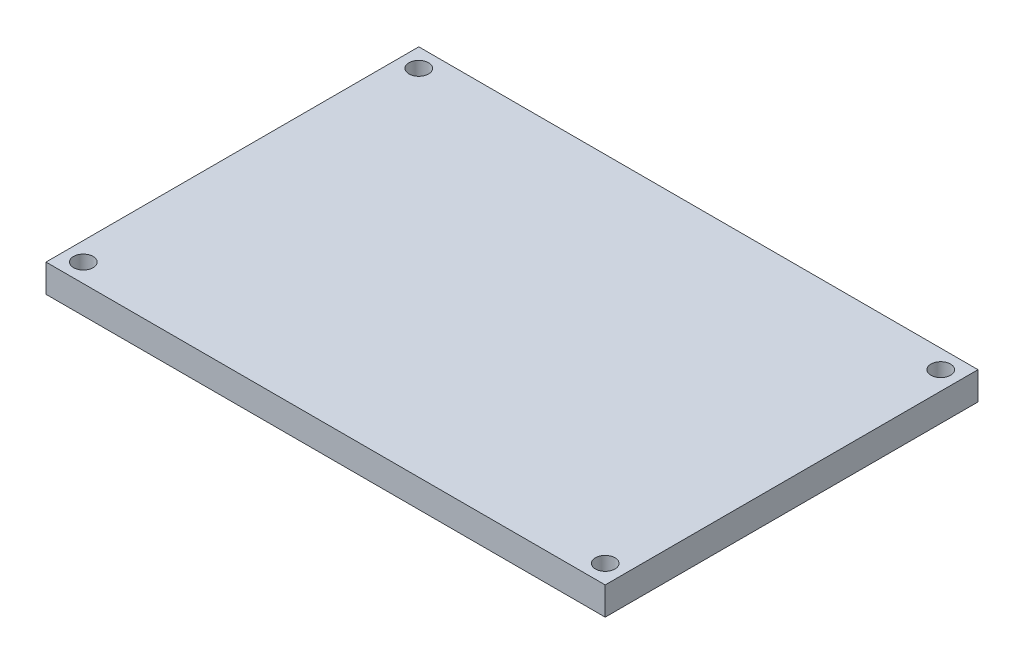
ISO-10303-21;
HEADER;
FILE_DESCRIPTION(('STEP AP214'),'2;1');
FILE_NAME('part.step','',(''),(''),'','','');
FILE_SCHEMA(('AUTOMOTIVE_DESIGN { 1 0 10303 214 1 1 1 1 }'));
ENDSEC;
DATA;
#1=APPLICATION_CONTEXT('core data for automotive mechanical design processes');
#2=APPLICATION_PROTOCOL_DEFINITION('international standard','automotive_design',2000,#1);
#3=PRODUCT_CONTEXT('',#1,'mechanical');
#4=PRODUCT('Part','Part','',(#3));
#5=PRODUCT_RELATED_PRODUCT_CATEGORY('part','',(#4));
#6=PRODUCT_DEFINITION_FORMATION('','',#4);
#7=PRODUCT_DEFINITION_CONTEXT('part definition',#1,'design');
#8=PRODUCT_DEFINITION('design','',#6,#7);
#9=PRODUCT_DEFINITION_SHAPE('','',#8);
#10=(LENGTH_UNIT() NAMED_UNIT(*) SI_UNIT(.MILLI.,.METRE.));
#11=(NAMED_UNIT(*) PLANE_ANGLE_UNIT() SI_UNIT($,.RADIAN.));
#12=(NAMED_UNIT(*) SI_UNIT($,.STERADIAN.) SOLID_ANGLE_UNIT());
#13=UNCERTAINTY_MEASURE_WITH_UNIT(LENGTH_MEASURE(1.E-05),#10,'distance_accuracy_value','');
#14=(GEOMETRIC_REPRESENTATION_CONTEXT(3) GLOBAL_UNCERTAINTY_ASSIGNED_CONTEXT((#13)) GLOBAL_UNIT_ASSIGNED_CONTEXT((#10,
#11,#12)) REPRESENTATION_CONTEXT('',''));
#15=CARTESIAN_POINT('',(0.,0.,0.));
#16=DIRECTION('',(0.,0.,1.));
#17=DIRECTION('',(1.,0.,0.));
#18=AXIS2_PLACEMENT_3D('',#15,#16,#17);
#19=CARTESIAN_POINT('',(0.,3.,-20.));
#20=DIRECTION('',(0.,0.,-1.));
#21=DIRECTION('',(-1.,0.,0.));
#22=AXIS2_PLACEMENT_3D('',#19,#20,#21);
#23=PLANE('',#22);
#24=DIRECTION('',(1.,0.,0.));
#25=VECTOR('',#24,1.);
#26=CARTESIAN_POINT('',(0.,0.,-20.));
#27=LINE('',#26,#25);
#28=CARTESIAN_POINT('',(-30.,0.,-20.));
#29=VERTEX_POINT('',#28);
#30=CARTESIAN_POINT('',(30.,0.,-20.));
#31=VERTEX_POINT('',#30);
#32=EDGE_CURVE('E117',#29,#31,#27,.T.);
#33=ORIENTED_EDGE('',*,*,#32,.F.);
#34=DIRECTION('',(0.,-1.,0.));
#35=VECTOR('',#34,1.);
#36=CARTESIAN_POINT('',(-30.,3.,-20.));
#37=LINE('',#36,#35);
#38=CARTESIAN_POINT('',(-30.,3.,-20.));
#39=VERTEX_POINT('',#38);
#40=EDGE_CURVE('E11',#39,#29,#37,.T.);
#41=ORIENTED_EDGE('',*,*,#40,.F.);
#42=DIRECTION('',(1.,0.,0.));
#43=VECTOR('',#42,1.);
#44=CARTESIAN_POINT('',(0.,3.,-20.));
#45=LINE('',#44,#43);
#46=CARTESIAN_POINT('',(30.,3.,-20.));
#47=VERTEX_POINT('',#46);
#48=EDGE_CURVE('E90',#39,#47,#45,.T.);
#49=ORIENTED_EDGE('',*,*,#48,.T.);
#50=DIRECTION('',(0.,-1.,0.));
#51=VECTOR('',#50,1.);
#52=CARTESIAN_POINT('',(30.,3.,-20.));
#53=LINE('',#52,#51);
#54=EDGE_CURVE('E57',#47,#31,#53,.T.);
#55=ORIENTED_EDGE('',*,*,#54,.T.);
#56=EDGE_LOOP('',(#33,#41,#49,#55));
#57=FACE_BOUND('',#56,.T.);
#58=ADVANCED_FACE('F41',(#57),#23,.T.);
#59=CARTESIAN_POINT('',(-30.,3.,0.));
#60=DIRECTION('',(1.,0.,0.));
#61=DIRECTION('',(0.,0.,-1.));
#62=AXIS2_PLACEMENT_3D('',#59,#60,#61);
#63=PLANE('',#62);
#64=DIRECTION('',(0.,0.,1.));
#65=VECTOR('',#64,1.);
#66=CARTESIAN_POINT('',(-30.,0.,0.));
#67=LINE('',#66,#65);
#68=CARTESIAN_POINT('',(-30.,0.,20.));
#69=VERTEX_POINT('',#68);
#70=EDGE_CURVE('E96',#29,#69,#67,.T.);
#71=ORIENTED_EDGE('',*,*,#70,.T.);
#72=DIRECTION('',(0.,-1.,0.));
#73=VECTOR('',#72,1.);
#74=CARTESIAN_POINT('',(-30.,3.,20.));
#75=LINE('',#74,#73);
#76=CARTESIAN_POINT('',(-30.,3.,20.));
#77=VERTEX_POINT('',#76);
#78=EDGE_CURVE('E49',#77,#69,#75,.T.);
#79=ORIENTED_EDGE('',*,*,#78,.F.);
#80=DIRECTION('',(0.,0.,1.));
#81=VECTOR('',#80,1.);
#82=CARTESIAN_POINT('',(-30.,3.,0.));
#83=LINE('',#82,#81);
#84=EDGE_CURVE('E83',#39,#77,#83,.T.);
#85=ORIENTED_EDGE('',*,*,#84,.F.);
#86=ORIENTED_EDGE('',*,*,#40,.T.);
#87=EDGE_LOOP('',(#71,#79,#85,#86));
#88=FACE_BOUND('',#87,.T.);
#89=ADVANCED_FACE('F94',(#88),#63,.F.);
#90=CARTESIAN_POINT('',(0.,3.,20.));
#91=DIRECTION('',(0.,0.,-1.));
#92=DIRECTION('',(-1.,0.,0.));
#93=AXIS2_PLACEMENT_3D('',#90,#91,#92);
#94=PLANE('',#93);
#95=DIRECTION('',(1.,0.,0.));
#96=VECTOR('',#95,1.);
#97=CARTESIAN_POINT('',(0.,0.,20.));
#98=LINE('',#97,#96);
#99=CARTESIAN_POINT('',(30.,0.,20.));
#100=VERTEX_POINT('',#99);
#101=EDGE_CURVE('E120',#69,#100,#98,.T.);
#102=ORIENTED_EDGE('',*,*,#101,.T.);
#103=DIRECTION('',(0.,-1.,0.));
#104=VECTOR('',#103,1.);
#105=CARTESIAN_POINT('',(30.,3.,20.));
#106=LINE('',#105,#104);
#107=CARTESIAN_POINT('',(30.,3.,20.));
#108=VERTEX_POINT('',#107);
#109=EDGE_CURVE('E71',#108,#100,#106,.T.);
#110=ORIENTED_EDGE('',*,*,#109,.F.);
#111=DIRECTION('',(1.,0.,0.));
#112=VECTOR('',#111,1.);
#113=CARTESIAN_POINT('',(0.,3.,20.));
#114=LINE('',#113,#112);
#115=EDGE_CURVE('E89',#77,#108,#114,.T.);
#116=ORIENTED_EDGE('',*,*,#115,.F.);
#117=ORIENTED_EDGE('',*,*,#78,.T.);
#118=EDGE_LOOP('',(#102,#110,#116,#117));
#119=FACE_BOUND('',#118,.T.);
#120=ADVANCED_FACE('F99',(#119),#94,.F.);
#121=CARTESIAN_POINT('',(-28.,3.,-18.));
#122=DIRECTION('',(0.,-1.,0.));
#123=DIRECTION('',(0.,0.,-1.));
#124=AXIS2_PLACEMENT_3D('',#121,#122,#123);
#125=CYLINDRICAL_SURFACE('',#124,1.05);
#126=CARTESIAN_POINT('',(-28.,3.,-18.));
#127=DIRECTION('',(0.,1.,0.));
#128=DIRECTION('',(0.,0.,1.));
#129=AXIS2_PLACEMENT_3D('',#126,#127,#128);
#130=CIRCLE('',#129,1.05);
#131=CARTESIAN_POINT('',(-28.,3.,-16.95));
#132=VERTEX_POINT('',#131);
#133=EDGE_CURVE('E111',#132,#132,#130,.T.);
#134=ORIENTED_EDGE('',*,*,#133,.T.);
#135=EDGE_LOOP('',(#134));
#136=FACE_BOUND('',#135,.T.);
#137=CARTESIAN_POINT('',(-28.,0.,-18.));
#138=DIRECTION('',(0.,1.,0.));
#139=DIRECTION('',(0.,0.,1.));
#140=AXIS2_PLACEMENT_3D('',#137,#138,#139);
#141=CIRCLE('',#140,1.05);
#142=CARTESIAN_POINT('',(-28.,0.,-16.95));
#143=VERTEX_POINT('',#142);
#144=EDGE_CURVE('E131',#143,#143,#141,.T.);
#145=ORIENTED_EDGE('',*,*,#144,.F.);
#146=EDGE_LOOP('',(#145));
#147=FACE_BOUND('',#146,.T.);
#148=ADVANCED_FACE('F162',(#136,#147),#125,.F.);
#149=CARTESIAN_POINT('',(-28.,3.,18.));
#150=DIRECTION('',(0.,-1.,0.));
#151=DIRECTION('',(0.,0.,-1.));
#152=AXIS2_PLACEMENT_3D('',#149,#150,#151);
#153=CYLINDRICAL_SURFACE('',#152,1.05);
#154=CARTESIAN_POINT('',(-28.,3.,18.));
#155=DIRECTION('',(0.,1.,0.));
#156=DIRECTION('',(0.,0.,1.));
#157=AXIS2_PLACEMENT_3D('',#154,#155,#156);
#158=CIRCLE('',#157,1.05);
#159=CARTESIAN_POINT('',(-28.,3.,19.05));
#160=VERTEX_POINT('',#159);
#161=EDGE_CURVE('E108',#160,#160,#158,.T.);
#162=ORIENTED_EDGE('',*,*,#161,.T.);
#163=EDGE_LOOP('',(#162));
#164=FACE_BOUND('',#163,.T.);
#165=CARTESIAN_POINT('',(-28.,0.,18.));
#166=DIRECTION('',(0.,1.,0.));
#167=DIRECTION('',(0.,0.,1.));
#168=AXIS2_PLACEMENT_3D('',#165,#166,#167);
#169=CIRCLE('',#168,1.05);
#170=CARTESIAN_POINT('',(-28.,0.,19.05));
#171=VERTEX_POINT('',#170);
#172=EDGE_CURVE('E128',#171,#171,#169,.T.);
#173=ORIENTED_EDGE('',*,*,#172,.F.);
#174=EDGE_LOOP('',(#173));
#175=FACE_BOUND('',#174,.T.);
#176=ADVANCED_FACE('F151',(#164,#175),#153,.F.);
#177=CARTESIAN_POINT('',(28.,3.,18.));
#178=DIRECTION('',(0.,-1.,0.));
#179=DIRECTION('',(0.,0.,-1.));
#180=AXIS2_PLACEMENT_3D('',#177,#178,#179);
#181=CYLINDRICAL_SURFACE('',#180,1.05);
#182=CARTESIAN_POINT('',(28.,3.,18.));
#183=DIRECTION('',(0.,1.,0.));
#184=DIRECTION('',(0.,0.,1.));
#185=AXIS2_PLACEMENT_3D('',#182,#183,#184);
#186=CIRCLE('',#185,1.05);
#187=CARTESIAN_POINT('',(28.,3.,19.05));
#188=VERTEX_POINT('',#187);
#189=EDGE_CURVE('E102',#188,#188,#186,.F.);
#190=ORIENTED_EDGE('',*,*,#189,.F.);
#191=EDGE_LOOP('',(#190));
#192=FACE_BOUND('',#191,.T.);
#193=CARTESIAN_POINT('',(28.,0.,18.));
#194=DIRECTION('',(0.,1.,0.));
#195=DIRECTION('',(0.,0.,1.));
#196=AXIS2_PLACEMENT_3D('',#193,#194,#195);
#197=CIRCLE('',#196,1.05);
#198=CARTESIAN_POINT('',(28.,0.,19.05));
#199=VERTEX_POINT('',#198);
#200=EDGE_CURVE('E125',#199,#199,#197,.F.);
#201=ORIENTED_EDGE('',*,*,#200,.T.);
#202=EDGE_LOOP('',(#201));
#203=FACE_BOUND('',#202,.T.);
#204=ADVANCED_FACE('F143',(#192,#203),#181,.F.);
#205=CARTESIAN_POINT('',(30.,3.,0.));
#206=DIRECTION('',(1.,0.,0.));
#207=DIRECTION('',(0.,0.,-1.));
#208=AXIS2_PLACEMENT_3D('',#205,#206,#207);
#209=PLANE('',#208);
#210=DIRECTION('',(0.,0.,1.));
#211=VECTOR('',#210,1.);
#212=CARTESIAN_POINT('',(30.,0.,0.));
#213=LINE('',#212,#211);
#214=EDGE_CURVE('E122',#31,#100,#213,.T.);
#215=ORIENTED_EDGE('',*,*,#214,.F.);
#216=ORIENTED_EDGE('',*,*,#54,.F.);
#217=DIRECTION('',(0.,0.,1.));
#218=VECTOR('',#217,1.);
#219=CARTESIAN_POINT('',(30.,3.,0.));
#220=LINE('',#219,#218);
#221=EDGE_CURVE('E100',#47,#108,#220,.T.);
#222=ORIENTED_EDGE('',*,*,#221,.T.);
#223=ORIENTED_EDGE('',*,*,#109,.T.);
#224=EDGE_LOOP('',(#215,#216,#222,#223));
#225=FACE_BOUND('',#224,.T.);
#226=ADVANCED_FACE('F140',(#225),#209,.T.);
#227=CARTESIAN_POINT('',(28.,3.,-18.));
#228=DIRECTION('',(0.,-1.,0.));
#229=DIRECTION('',(0.,0.,-1.));
#230=AXIS2_PLACEMENT_3D('',#227,#228,#229);
#231=CYLINDRICAL_SURFACE('',#230,1.05);
#232=CARTESIAN_POINT('',(28.,3.,-18.));
#233=DIRECTION('',(0.,1.,0.));
#234=DIRECTION('',(0.,0.,1.));
#235=AXIS2_PLACEMENT_3D('',#232,#233,#234);
#236=CIRCLE('',#235,1.05);
#237=CARTESIAN_POINT('',(28.,3.,-16.95));
#238=VERTEX_POINT('',#237);
#239=EDGE_CURVE('E114',#238,#238,#236,.F.);
#240=ORIENTED_EDGE('',*,*,#239,.F.);
#241=EDGE_LOOP('',(#240));
#242=FACE_BOUND('',#241,.T.);
#243=CARTESIAN_POINT('',(28.,0.,-18.));
#244=DIRECTION('',(0.,1.,0.));
#245=DIRECTION('',(0.,0.,1.));
#246=AXIS2_PLACEMENT_3D('',#243,#244,#245);
#247=CIRCLE('',#246,1.05);
#248=CARTESIAN_POINT('',(28.,0.,-16.95));
#249=VERTEX_POINT('',#248);
#250=EDGE_CURVE('E134',#249,#249,#247,.F.);
#251=ORIENTED_EDGE('',*,*,#250,.T.);
#252=EDGE_LOOP('',(#251));
#253=FACE_BOUND('',#252,.T.);
#254=ADVANCED_FACE('F142',(#242,#253),#231,.F.);
#255=CARTESIAN_POINT('',(0.,3.,0.));
#256=DIRECTION('',(0.,1.,0.));
#257=DIRECTION('',(0.,0.,1.));
#258=AXIS2_PLACEMENT_3D('',#255,#256,#257);
#259=PLANE('',#258);
#260=ORIENTED_EDGE('',*,*,#48,.F.);
#261=ORIENTED_EDGE('',*,*,#84,.T.);
#262=ORIENTED_EDGE('',*,*,#115,.T.);
#263=ORIENTED_EDGE('',*,*,#221,.F.);
#264=EDGE_LOOP('',(#260,#261,#262,#263));
#265=FACE_BOUND('',#264,.T.);
#266=ORIENTED_EDGE('',*,*,#189,.T.);
#267=EDGE_LOOP('',(#266));
#268=FACE_BOUND('',#267,.T.);
#269=ORIENTED_EDGE('',*,*,#161,.F.);
#270=EDGE_LOOP('',(#269));
#271=FACE_BOUND('',#270,.T.);
#272=ORIENTED_EDGE('',*,*,#133,.F.);
#273=EDGE_LOOP('',(#272));
#274=FACE_BOUND('',#273,.T.);
#275=ORIENTED_EDGE('',*,*,#239,.T.);
#276=EDGE_LOOP('',(#275));
#277=FACE_BOUND('',#276,.T.);
#278=ADVANCED_FACE('F85',(#265,#268,#271,#274,#277),#259,.T.);
#279=CARTESIAN_POINT('',(0.,0.,0.));
#280=DIRECTION('',(0.,1.,0.));
#281=DIRECTION('',(0.,0.,1.));
#282=AXIS2_PLACEMENT_3D('',#279,#280,#281);
#283=PLANE('',#282);
#284=ORIENTED_EDGE('',*,*,#32,.T.);
#285=ORIENTED_EDGE('',*,*,#214,.T.);
#286=ORIENTED_EDGE('',*,*,#101,.F.);
#287=ORIENTED_EDGE('',*,*,#70,.F.);
#288=EDGE_LOOP('',(#284,#285,#286,#287));
#289=FACE_BOUND('',#288,.T.);
#290=ORIENTED_EDGE('',*,*,#200,.F.);
#291=EDGE_LOOP('',(#290));
#292=FACE_BOUND('',#291,.T.);
#293=ORIENTED_EDGE('',*,*,#172,.T.);
#294=EDGE_LOOP('',(#293));
#295=FACE_BOUND('',#294,.T.);
#296=ORIENTED_EDGE('',*,*,#144,.T.);
#297=EDGE_LOOP('',(#296));
#298=FACE_BOUND('',#297,.T.);
#299=ORIENTED_EDGE('',*,*,#250,.F.);
#300=EDGE_LOOP('',(#299));
#301=FACE_BOUND('',#300,.T.);
#302=ADVANCED_FACE('F175',(#289,#292,#295,#298,#301),#283,.F.);
#303=CLOSED_SHELL('',(#58,#89,#120,#148,#176,#204,#226,#254,#278,#302));
#304=MANIFOLD_SOLID_BREP('B2',#303);
#305=ADVANCED_BREP_SHAPE_REPRESENTATION('',(#18,#304),#14);
#306=SHAPE_DEFINITION_REPRESENTATION(#9,#305);
ENDSEC;
END-ISO-10303-21;
